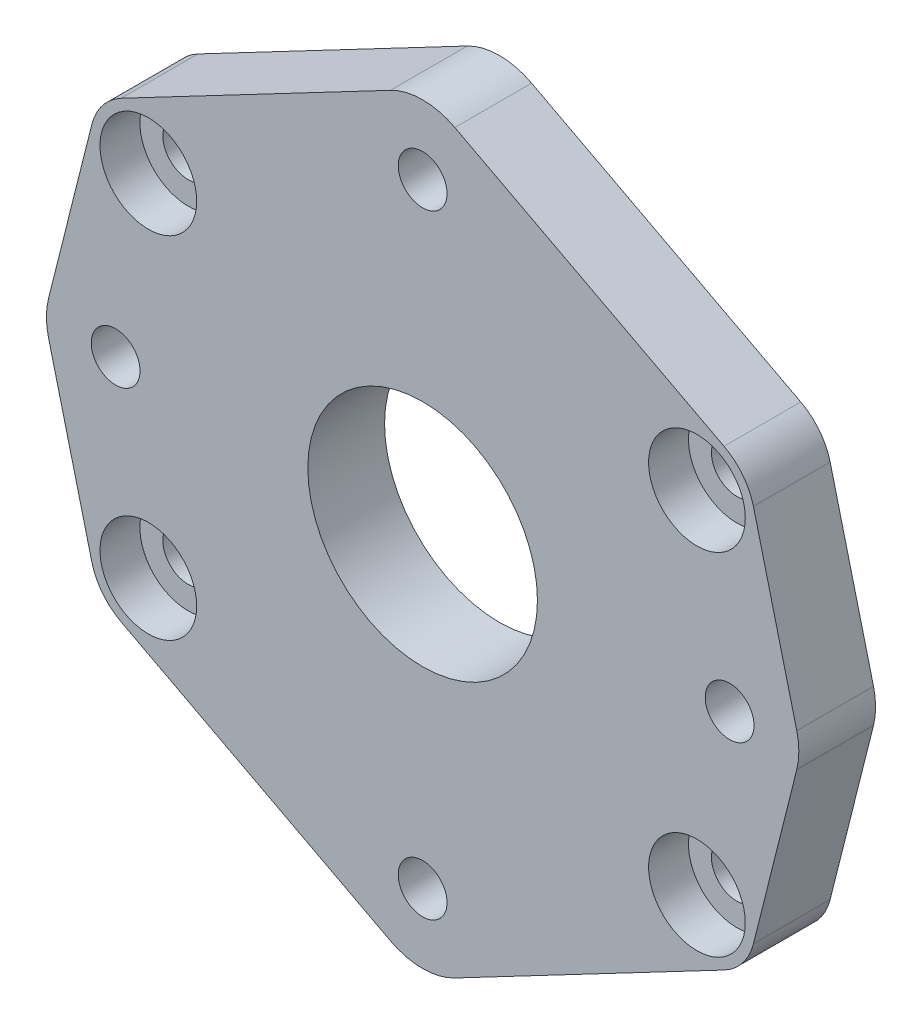
ISO-10303-21;
HEADER;
FILE_DESCRIPTION(('STEP AP214'),'2;1');
FILE_NAME('part.step','',(''),(''),'','','');
FILE_SCHEMA(('AUTOMOTIVE_DESIGN { 1 0 10303 214 1 1 1 1 }'));
ENDSEC;
DATA;
#1=APPLICATION_CONTEXT('core data for automotive mechanical design processes');
#2=APPLICATION_PROTOCOL_DEFINITION('international standard','automotive_design',2000,#1);
#3=PRODUCT_CONTEXT('',#1,'mechanical');
#4=PRODUCT('Part','Part','',(#3));
#5=PRODUCT_RELATED_PRODUCT_CATEGORY('part','',(#4));
#6=PRODUCT_DEFINITION_FORMATION('','',#4);
#7=PRODUCT_DEFINITION_CONTEXT('part definition',#1,'design');
#8=PRODUCT_DEFINITION('design','',#6,#7);
#9=PRODUCT_DEFINITION_SHAPE('','',#8);
#10=(LENGTH_UNIT() NAMED_UNIT(*) SI_UNIT(.MILLI.,.METRE.));
#11=(NAMED_UNIT(*) PLANE_ANGLE_UNIT() SI_UNIT($,.RADIAN.));
#12=(NAMED_UNIT(*) SI_UNIT($,.STERADIAN.) SOLID_ANGLE_UNIT());
#13=UNCERTAINTY_MEASURE_WITH_UNIT(LENGTH_MEASURE(1.E-05),#10,'distance_accuracy_value','');
#14=(GEOMETRIC_REPRESENTATION_CONTEXT(3) GLOBAL_UNCERTAINTY_ASSIGNED_CONTEXT((#13)) GLOBAL_UNIT_ASSIGNED_CONTEXT((#10,
#11,#12)) REPRESENTATION_CONTEXT('',''));
#15=CARTESIAN_POINT('',(0.,0.,0.));
#16=DIRECTION('',(0.,0.,1.));
#17=DIRECTION('',(1.,0.,0.));
#18=AXIS2_PLACEMENT_3D('',#15,#16,#17);
#19=CARTESIAN_POINT('',(22.6949,14.5,3.05));
#20=DIRECTION('',(0.,0.,1.));
#21=DIRECTION('',(1.,0.,0.));
#22=AXIS2_PLACEMENT_3D('',#19,#20,#21);
#23=CYLINDRICAL_SURFACE('',#22,4.);
#24=CARTESIAN_POINT('',(22.6949,14.5,6.35));
#25=DIRECTION('',(0.,0.,1.));
#26=DIRECTION('',(1.,0.,0.));
#27=AXIS2_PLACEMENT_3D('',#24,#25,#26);
#28=CIRCLE('',#27,4.);
#29=CARTESIAN_POINT('',(26.6949,14.5,6.35));
#30=VERTEX_POINT('',#29);
#31=EDGE_CURVE('E20',#30,#30,#28,.F.);
#32=ORIENTED_EDGE('',*,*,#31,.F.);
#33=EDGE_LOOP('',(#32));
#34=FACE_BOUND('',#33,.T.);
#35=CARTESIAN_POINT('',(22.6949,14.5,3.05));
#36=DIRECTION('',(0.,0.,1.));
#37=DIRECTION('',(1.,0.,0.));
#38=AXIS2_PLACEMENT_3D('',#35,#36,#37);
#39=CIRCLE('',#38,4.);
#40=CARTESIAN_POINT('',(26.6949,14.5,3.05));
#41=VERTEX_POINT('',#40);
#42=EDGE_CURVE('E289',#41,#41,#39,.T.);
#43=ORIENTED_EDGE('',*,*,#42,.F.);
#44=EDGE_LOOP('',(#43));
#45=FACE_BOUND('',#44,.T.);
#46=ADVANCED_FACE('F17',(#34,#45),#23,.F.);
#47=CARTESIAN_POINT('',(22.6949,-14.5,3.05));
#48=DIRECTION('',(0.,0.,1.));
#49=DIRECTION('',(1.,0.,0.));
#50=AXIS2_PLACEMENT_3D('',#47,#48,#49);
#51=CYLINDRICAL_SURFACE('',#50,4.);
#52=CARTESIAN_POINT('',(22.6949,-14.5,6.35));
#53=DIRECTION('',(0.,0.,1.));
#54=DIRECTION('',(1.,0.,0.));
#55=AXIS2_PLACEMENT_3D('',#52,#53,#54);
#56=CIRCLE('',#55,4.);
#57=CARTESIAN_POINT('',(26.6949,-14.5,6.35));
#58=VERTEX_POINT('',#57);
#59=EDGE_CURVE('E297',#58,#58,#56,.F.);
#60=ORIENTED_EDGE('',*,*,#59,.F.);
#61=EDGE_LOOP('',(#60));
#62=FACE_BOUND('',#61,.T.);
#63=CARTESIAN_POINT('',(22.6949,-14.5,3.05));
#64=DIRECTION('',(0.,0.,1.));
#65=DIRECTION('',(1.,0.,0.));
#66=AXIS2_PLACEMENT_3D('',#63,#64,#65);
#67=CIRCLE('',#66,4.);
#68=CARTESIAN_POINT('',(26.6949,-14.5,3.05));
#69=VERTEX_POINT('',#68);
#70=EDGE_CURVE('E286',#69,#69,#67,.T.);
#71=ORIENTED_EDGE('',*,*,#70,.F.);
#72=EDGE_LOOP('',(#71));
#73=FACE_BOUND('',#72,.T.);
#74=ADVANCED_FACE('F307',(#62,#73),#51,.F.);
#75=CARTESIAN_POINT('',(-22.6949,14.5,3.05));
#76=DIRECTION('',(0.,0.,1.));
#77=DIRECTION('',(1.,0.,0.));
#78=AXIS2_PLACEMENT_3D('',#75,#76,#77);
#79=CYLINDRICAL_SURFACE('',#78,4.);
#80=CARTESIAN_POINT('',(-22.6949,14.5,6.35));
#81=DIRECTION('',(0.,0.,1.));
#82=DIRECTION('',(1.,0.,0.));
#83=AXIS2_PLACEMENT_3D('',#80,#81,#82);
#84=CIRCLE('',#83,4.);
#85=CARTESIAN_POINT('',(-18.6949,14.5,6.35));
#86=VERTEX_POINT('',#85);
#87=EDGE_CURVE('E292',#86,#86,#84,.F.);
#88=ORIENTED_EDGE('',*,*,#87,.F.);
#89=EDGE_LOOP('',(#88));
#90=FACE_BOUND('',#89,.T.);
#91=CARTESIAN_POINT('',(-22.6949,14.5,3.05));
#92=DIRECTION('',(0.,0.,1.));
#93=DIRECTION('',(1.,0.,0.));
#94=AXIS2_PLACEMENT_3D('',#91,#92,#93);
#95=CIRCLE('',#94,4.);
#96=CARTESIAN_POINT('',(-18.6949,14.5,3.05));
#97=VERTEX_POINT('',#96);
#98=EDGE_CURVE('E283',#97,#97,#95,.T.);
#99=ORIENTED_EDGE('',*,*,#98,.F.);
#100=EDGE_LOOP('',(#99));
#101=FACE_BOUND('',#100,.T.);
#102=ADVANCED_FACE('F377',(#90,#101),#79,.F.);
#103=CARTESIAN_POINT('',(-22.6949,-14.5,3.05));
#104=DIRECTION('',(0.,0.,1.));
#105=DIRECTION('',(1.,0.,0.));
#106=AXIS2_PLACEMENT_3D('',#103,#104,#105);
#107=CYLINDRICAL_SURFACE('',#106,4.);
#108=CARTESIAN_POINT('',(-22.6949,-14.5,6.35));
#109=DIRECTION('',(0.,0.,1.));
#110=DIRECTION('',(1.,0.,0.));
#111=AXIS2_PLACEMENT_3D('',#108,#109,#110);
#112=CIRCLE('',#111,4.);
#113=CARTESIAN_POINT('',(-18.6949,-14.5,6.35));
#114=VERTEX_POINT('',#113);
#115=EDGE_CURVE('E295',#114,#114,#112,.F.);
#116=ORIENTED_EDGE('',*,*,#115,.F.);
#117=EDGE_LOOP('',(#116));
#118=FACE_BOUND('',#117,.T.);
#119=CARTESIAN_POINT('',(-22.6949,-14.5,3.05));
#120=DIRECTION('',(0.,0.,1.));
#121=DIRECTION('',(1.,0.,0.));
#122=AXIS2_PLACEMENT_3D('',#119,#120,#121);
#123=CIRCLE('',#122,4.);
#124=CARTESIAN_POINT('',(-18.6949,-14.5,3.05));
#125=VERTEX_POINT('',#124);
#126=EDGE_CURVE('E280',#125,#125,#123,.T.);
#127=ORIENTED_EDGE('',*,*,#126,.F.);
#128=EDGE_LOOP('',(#127));
#129=FACE_BOUND('',#128,.T.);
#130=ADVANCED_FACE('F373',(#118,#129),#107,.F.);
#131=CARTESIAN_POINT('',(0.,-25.4,6.35));
#132=DIRECTION('',(0.,0.,1.));
#133=DIRECTION('',(1.,0.,0.));
#134=AXIS2_PLACEMENT_3D('',#131,#132,#133);
#135=PLANE('',#134);
#136=CARTESIAN_POINT('',(0.,0.,6.35));
#137=DIRECTION('',(0.,0.,-1.));
#138=DIRECTION('',(-1.,0.,0.));
#139=AXIS2_PLACEMENT_3D('',#136,#137,#138);
#140=CIRCLE('',#139,9.5);
#141=CARTESIAN_POINT('',(-9.5,0.,6.35));
#142=VERTEX_POINT('',#141);
#143=EDGE_CURVE('E253',#142,#142,#140,.T.);
#144=ORIENTED_EDGE('',*,*,#143,.T.);
#145=EDGE_LOOP('',(#144));
#146=FACE_BOUND('',#145,.T.);
#147=CARTESIAN_POINT('',(-22.6949,-14.5,6.35));
#148=DIRECTION('',(0.,0.,-1.));
#149=DIRECTION('',(-1.,0.,0.));
#150=AXIS2_PLACEMENT_3D('',#147,#148,#149);
#151=CIRCLE('',#150,4.8184481321629);
#152=CARTESIAN_POINT('',(-24.9364972451946,-18.7652882895157,6.35));
#153=VERTEX_POINT('',#152);
#154=CARTESIAN_POINT('',(-27.3681433155589,-15.6739843763561,6.35));
#155=VERTEX_POINT('',#154);
#156=EDGE_CURVE('E165',#153,#155,#151,.T.);
#157=ORIENTED_EDGE('',*,*,#156,.F.);
#158=DIRECTION('',(-0.885199585535674,0.465211450597973,0.));
#159=VECTOR('',#158,1.);
#160=CARTESIAN_POINT('',(-24.9364972451946,-18.7652882895157,6.35));
#161=LINE('',#160,#159);
#162=CARTESIAN_POINT('',(-2.66459162559,-30.4701576660727,6.35));
#163=VERTEX_POINT('',#162);
#164=EDGE_CURVE('E158',#153,#163,#161,.F.);
#165=ORIENTED_EDGE('',*,*,#164,.T.);
#166=CARTESIAN_POINT('',(0.,-25.4,6.35));
#167=DIRECTION('',(0.,0.,-1.));
#168=DIRECTION('',(-1.,0.,0.));
#169=AXIS2_PLACEMENT_3D('',#166,#167,#168);
#170=CIRCLE('',#169,5.7277);
#171=CARTESIAN_POINT('',(2.66459162559002,-30.4701576660727,6.35));
#172=VERTEX_POINT('',#171);
#173=EDGE_CURVE('E144',#172,#163,#170,.T.);
#174=ORIENTED_EDGE('',*,*,#173,.F.);
#175=DIRECTION('',(-0.885199585535674,-0.465211450597973,0.));
#176=VECTOR('',#175,1.);
#177=CARTESIAN_POINT('',(24.9364972451946,-18.7652882895157,6.35));
#178=LINE('',#177,#176);
#179=CARTESIAN_POINT('',(24.9364972451946,-18.7652882895157,6.35));
#180=VERTEX_POINT('',#179);
#181=EDGE_CURVE('E138',#172,#180,#178,.F.);
#182=ORIENTED_EDGE('',*,*,#181,.T.);
#183=CARTESIAN_POINT('',(22.6949,-14.5,6.35));
#184=DIRECTION('',(0.,0.,-1.));
#185=DIRECTION('',(-1.,0.,0.));
#186=AXIS2_PLACEMENT_3D('',#183,#184,#185);
#187=CIRCLE('',#186,4.81844813216289);
#188=CARTESIAN_POINT('',(27.3681433155589,-15.6739843763561,6.35));
#189=VERTEX_POINT('',#188);
#190=EDGE_CURVE('E128',#189,#180,#187,.T.);
#191=ORIENTED_EDGE('',*,*,#190,.F.);
#192=DIRECTION('',(-0.243643667868879,-0.969864816924193,0.));
#193=VECTOR('',#192,1.);
#194=CARTESIAN_POINT('',(27.3681433155589,-15.6739843763561,6.35));
#195=LINE('',#194,#193);
#196=CARTESIAN_POINT('',(30.9550947118967,-1.39551783645258,6.35));
#197=VERTEX_POINT('',#196);
#198=EDGE_CURVE('E154',#189,#197,#195,.F.);
#199=ORIENTED_EDGE('',*,*,#198,.T.);
#200=CARTESIAN_POINT('',(25.4,0.,6.35));
#201=DIRECTION('',(0.,0.,-1.));
#202=DIRECTION('',(-1.,0.,0.));
#203=AXIS2_PLACEMENT_3D('',#200,#201,#202);
#204=CIRCLE('',#203,5.72770000000001);
#205=CARTESIAN_POINT('',(30.9550947118967,1.39551783645258,6.35));
#206=VERTEX_POINT('',#205);
#207=EDGE_CURVE('E187',#206,#197,#204,.T.);
#208=ORIENTED_EDGE('',*,*,#207,.F.);
#209=DIRECTION('',(0.243643667868879,-0.969864816924193,0.));
#210=VECTOR('',#209,1.);
#211=CARTESIAN_POINT('',(27.3681433155589,15.6739843763561,6.35));
#212=LINE('',#211,#210);
#213=CARTESIAN_POINT('',(27.3681433155589,15.6739843763561,6.35));
#214=VERTEX_POINT('',#213);
#215=EDGE_CURVE('E182',#206,#214,#212,.F.);
#216=ORIENTED_EDGE('',*,*,#215,.T.);
#217=CARTESIAN_POINT('',(22.6949,14.5,6.35));
#218=DIRECTION('',(0.,0.,-1.));
#219=DIRECTION('',(-1.,0.,0.));
#220=AXIS2_PLACEMENT_3D('',#217,#218,#219);
#221=CIRCLE('',#220,4.81844813216289);
#222=CARTESIAN_POINT('',(24.9364972451946,18.7652882895157,6.35));
#223=VERTEX_POINT('',#222);
#224=EDGE_CURVE('E185',#223,#214,#221,.T.);
#225=ORIENTED_EDGE('',*,*,#224,.F.);
#226=DIRECTION('',(0.885199585535674,-0.465211450597973,0.));
#227=VECTOR('',#226,1.);
#228=CARTESIAN_POINT('',(24.9364972451946,18.7652882895157,6.35));
#229=LINE('',#228,#227);
#230=CARTESIAN_POINT('',(2.66459162559001,30.4701576660727,6.35));
#231=VERTEX_POINT('',#230);
#232=EDGE_CURVE('E177',#223,#231,#229,.F.);
#233=ORIENTED_EDGE('',*,*,#232,.T.);
#234=CARTESIAN_POINT('',(0.,25.4,6.35));
#235=DIRECTION('',(0.,0.,-1.));
#236=DIRECTION('',(-1.,0.,0.));
#237=AXIS2_PLACEMENT_3D('',#234,#235,#236);
#238=CIRCLE('',#237,5.7277);
#239=CARTESIAN_POINT('',(-2.66459162559001,30.4701576660727,6.35));
#240=VERTEX_POINT('',#239);
#241=EDGE_CURVE('E180',#240,#231,#238,.T.);
#242=ORIENTED_EDGE('',*,*,#241,.F.);
#243=DIRECTION('',(0.885199585535674,0.465211450597973,0.));
#244=VECTOR('',#243,1.);
#245=CARTESIAN_POINT('',(-24.9364972451946,18.7652882895157,6.35));
#246=LINE('',#245,#244);
#247=CARTESIAN_POINT('',(-24.9364972451946,18.7652882895157,6.35));
#248=VERTEX_POINT('',#247);
#249=EDGE_CURVE('E172',#240,#248,#246,.F.);
#250=ORIENTED_EDGE('',*,*,#249,.T.);
#251=CARTESIAN_POINT('',(-22.6949,14.5,6.35));
#252=DIRECTION('',(0.,0.,-1.));
#253=DIRECTION('',(-1.,0.,0.));
#254=AXIS2_PLACEMENT_3D('',#251,#252,#253);
#255=CIRCLE('',#254,4.81844813216289);
#256=CARTESIAN_POINT('',(-27.3681433155589,15.6739843763561,6.35));
#257=VERTEX_POINT('',#256);
#258=EDGE_CURVE('E175',#257,#248,#255,.T.);
#259=ORIENTED_EDGE('',*,*,#258,.F.);
#260=DIRECTION('',(0.243643667868879,0.969864816924194,0.));
#261=VECTOR('',#260,1.);
#262=CARTESIAN_POINT('',(-27.3681433155589,15.6739843763561,6.35));
#263=LINE('',#262,#261);
#264=CARTESIAN_POINT('',(-30.9550947118967,1.39551783645258,6.35));
#265=VERTEX_POINT('',#264);
#266=EDGE_CURVE('E167',#257,#265,#263,.F.);
#267=ORIENTED_EDGE('',*,*,#266,.T.);
#268=CARTESIAN_POINT('',(-25.4,0.,6.35));
#269=DIRECTION('',(0.,0.,-1.));
#270=DIRECTION('',(-1.,0.,0.));
#271=AXIS2_PLACEMENT_3D('',#268,#269,#270);
#272=CIRCLE('',#271,5.7277);
#273=CARTESIAN_POINT('',(-30.9550947118967,-1.39551783645258,6.35));
#274=VERTEX_POINT('',#273);
#275=EDGE_CURVE('E170',#274,#265,#272,.T.);
#276=ORIENTED_EDGE('',*,*,#275,.F.);
#277=DIRECTION('',(-0.243643667868879,0.969864816924194,0.));
#278=VECTOR('',#277,1.);
#279=CARTESIAN_POINT('',(-27.3681433155589,-15.6739843763561,6.35));
#280=LINE('',#279,#278);
#281=EDGE_CURVE('E162',#274,#155,#280,.F.);
#282=ORIENTED_EDGE('',*,*,#281,.T.);
#283=EDGE_LOOP('',(#157,#165,#174,#182,#191,#199,#208,#216,#225,#233,#242,#250,#259,#267,#276,#282));
#284=FACE_BOUND('',#283,.T.);
#285=CARTESIAN_POINT('',(0.,-25.4,6.35));
#286=DIRECTION('',(0.,0.,1.));
#287=DIRECTION('',(1.,0.,0.));
#288=AXIS2_PLACEMENT_3D('',#285,#286,#287);
#289=CIRCLE('',#288,2.01929999999999);
#290=CARTESIAN_POINT('',(2.0193,-25.4,6.35));
#291=VERTEX_POINT('',#290);
#292=EDGE_CURVE('E148',#291,#291,#289,.F.);
#293=ORIENTED_EDGE('',*,*,#292,.T.);
#294=EDGE_LOOP('',(#293));
#295=FACE_BOUND('',#294,.T.);
#296=CARTESIAN_POINT('',(25.4,0.,6.35));
#297=DIRECTION('',(0.,0.,1.));
#298=DIRECTION('',(1.,0.,0.));
#299=AXIS2_PLACEMENT_3D('',#296,#297,#298);
#300=CIRCLE('',#299,2.01929999999999);
#301=CARTESIAN_POINT('',(27.4193,0.,6.35));
#302=VERTEX_POINT('',#301);
#303=EDGE_CURVE('E271',#302,#302,#300,.F.);
#304=ORIENTED_EDGE('',*,*,#303,.T.);
#305=EDGE_LOOP('',(#304));
#306=FACE_BOUND('',#305,.T.);
#307=CARTESIAN_POINT('',(0.,25.4,6.35));
#308=DIRECTION('',(0.,0.,1.));
#309=DIRECTION('',(1.,0.,0.));
#310=AXIS2_PLACEMENT_3D('',#307,#308,#309);
#311=CIRCLE('',#310,2.01929999999999);
#312=CARTESIAN_POINT('',(2.0193,25.4,6.35));
#313=VERTEX_POINT('',#312);
#314=EDGE_CURVE('E274',#313,#313,#311,.F.);
#315=ORIENTED_EDGE('',*,*,#314,.T.);
#316=EDGE_LOOP('',(#315));
#317=FACE_BOUND('',#316,.T.);
#318=CARTESIAN_POINT('',(-25.4,0.,6.35));
#319=DIRECTION('',(0.,0.,1.));
#320=DIRECTION('',(1.,0.,0.));
#321=AXIS2_PLACEMENT_3D('',#318,#319,#320);
#322=CIRCLE('',#321,2.01929999999999);
#323=CARTESIAN_POINT('',(-23.3807,0.,6.35));
#324=VERTEX_POINT('',#323);
#325=EDGE_CURVE('E277',#324,#324,#322,.F.);
#326=ORIENTED_EDGE('',*,*,#325,.T.);
#327=EDGE_LOOP('',(#326));
#328=FACE_BOUND('',#327,.T.);
#329=ORIENTED_EDGE('',*,*,#87,.T.);
#330=EDGE_LOOP('',(#329));
#331=FACE_BOUND('',#330,.T.);
#332=ORIENTED_EDGE('',*,*,#115,.T.);
#333=EDGE_LOOP('',(#332));
#334=FACE_BOUND('',#333,.T.);
#335=ORIENTED_EDGE('',*,*,#59,.T.);
#336=EDGE_LOOP('',(#335));
#337=FACE_BOUND('',#336,.T.);
#338=ORIENTED_EDGE('',*,*,#31,.T.);
#339=EDGE_LOOP('',(#338));
#340=FACE_BOUND('',#339,.T.);
#341=ADVANCED_FACE('F141',(#146,#284,#295,#306,#317,#328,#331,#334,#337,#340),#135,.T.);
#342=CARTESIAN_POINT('',(22.6949,14.5,3.05));
#343=DIRECTION('',(0.,0.,1.));
#344=DIRECTION('',(1.,0.,0.));
#345=AXIS2_PLACEMENT_3D('',#342,#343,#344);
#346=PLANE('',#345);
#347=ORIENTED_EDGE('',*,*,#42,.T.);
#348=EDGE_LOOP('',(#347));
#349=FACE_BOUND('',#348,.T.);
#350=CARTESIAN_POINT('',(22.6949,14.5,3.05));
#351=DIRECTION('',(0.,0.,-1.));
#352=DIRECTION('',(-1.,0.,0.));
#353=AXIS2_PLACEMENT_3D('',#350,#351,#352);
#354=CIRCLE('',#353,2.1);
#355=CARTESIAN_POINT('',(20.5949,14.5,3.05));
#356=VERTEX_POINT('',#355);
#357=EDGE_CURVE('E250',#356,#356,#354,.T.);
#358=ORIENTED_EDGE('',*,*,#357,.T.);
#359=EDGE_LOOP('',(#358));
#360=FACE_BOUND('',#359,.T.);
#361=ADVANCED_FACE('F310',(#349,#360),#346,.T.);
#362=CARTESIAN_POINT('',(22.6949,-14.5,3.05));
#363=DIRECTION('',(0.,0.,1.));
#364=DIRECTION('',(1.,0.,0.));
#365=AXIS2_PLACEMENT_3D('',#362,#363,#364);
#366=PLANE('',#365);
#367=ORIENTED_EDGE('',*,*,#70,.T.);
#368=EDGE_LOOP('',(#367));
#369=FACE_BOUND('',#368,.T.);
#370=CARTESIAN_POINT('',(22.6949,-14.5,3.05));
#371=DIRECTION('',(0.,0.,-1.));
#372=DIRECTION('',(-1.,0.,0.));
#373=AXIS2_PLACEMENT_3D('',#370,#371,#372);
#374=CIRCLE('',#373,2.1);
#375=CARTESIAN_POINT('',(20.5949,-14.5,3.05));
#376=VERTEX_POINT('',#375);
#377=EDGE_CURVE('E247',#376,#376,#374,.T.);
#378=ORIENTED_EDGE('',*,*,#377,.T.);
#379=EDGE_LOOP('',(#378));
#380=FACE_BOUND('',#379,.T.);
#381=ADVANCED_FACE('F313',(#369,#380),#366,.T.);
#382=CARTESIAN_POINT('',(-22.6949,14.5,3.05));
#383=DIRECTION('',(0.,0.,1.));
#384=DIRECTION('',(1.,0.,0.));
#385=AXIS2_PLACEMENT_3D('',#382,#383,#384);
#386=PLANE('',#385);
#387=ORIENTED_EDGE('',*,*,#98,.T.);
#388=EDGE_LOOP('',(#387));
#389=FACE_BOUND('',#388,.T.);
#390=CARTESIAN_POINT('',(-22.6949,14.5,3.05));
#391=DIRECTION('',(0.,0.,-1.));
#392=DIRECTION('',(-1.,0.,0.));
#393=AXIS2_PLACEMENT_3D('',#390,#391,#392);
#394=CIRCLE('',#393,2.1);
#395=CARTESIAN_POINT('',(-24.7949,14.5,3.05));
#396=VERTEX_POINT('',#395);
#397=EDGE_CURVE('E244',#396,#396,#394,.T.);
#398=ORIENTED_EDGE('',*,*,#397,.T.);
#399=EDGE_LOOP('',(#398));
#400=FACE_BOUND('',#399,.T.);
#401=ADVANCED_FACE('F359',(#389,#400),#386,.T.);
#402=CARTESIAN_POINT('',(-22.6949,-14.5,3.05));
#403=DIRECTION('',(0.,0.,1.));
#404=DIRECTION('',(1.,0.,0.));
#405=AXIS2_PLACEMENT_3D('',#402,#403,#404);
#406=PLANE('',#405);
#407=ORIENTED_EDGE('',*,*,#126,.T.);
#408=EDGE_LOOP('',(#407));
#409=FACE_BOUND('',#408,.T.);
#410=CARTESIAN_POINT('',(-22.6949,-14.5,3.05));
#411=DIRECTION('',(0.,0.,-1.));
#412=DIRECTION('',(-1.,0.,0.));
#413=AXIS2_PLACEMENT_3D('',#410,#411,#412);
#414=CIRCLE('',#413,2.1);
#415=CARTESIAN_POINT('',(-24.7949,-14.5,3.05));
#416=VERTEX_POINT('',#415);
#417=EDGE_CURVE('E241',#416,#416,#414,.T.);
#418=ORIENTED_EDGE('',*,*,#417,.T.);
#419=EDGE_LOOP('',(#418));
#420=FACE_BOUND('',#419,.T.);
#421=ADVANCED_FACE('F348',(#409,#420),#406,.T.);
#422=CARTESIAN_POINT('',(-25.4,0.,6.35));
#423=DIRECTION('',(0.,0.,1.));
#424=DIRECTION('',(1.,0.,0.));
#425=AXIS2_PLACEMENT_3D('',#422,#423,#424);
#426=CYLINDRICAL_SURFACE('',#425,2.01929999999999);
#427=ORIENTED_EDGE('',*,*,#325,.F.);
#428=EDGE_LOOP('',(#427));
#429=FACE_BOUND('',#428,.T.);
#430=CARTESIAN_POINT('',(-25.4,0.,0.));
#431=DIRECTION('',(0.,0.,1.));
#432=DIRECTION('',(1.,0.,0.));
#433=AXIS2_PLACEMENT_3D('',#430,#431,#432);
#434=CIRCLE('',#433,2.01929999999999);
#435=CARTESIAN_POINT('',(-23.3807,0.,0.));
#436=VERTEX_POINT('',#435);
#437=EDGE_CURVE('E238',#436,#436,#434,.F.);
#438=ORIENTED_EDGE('',*,*,#437,.T.);
#439=EDGE_LOOP('',(#438));
#440=FACE_BOUND('',#439,.T.);
#441=ADVANCED_FACE('F345',(#429,#440),#426,.F.);
#442=CARTESIAN_POINT('',(0.,25.4,6.35));
#443=DIRECTION('',(0.,0.,1.));
#444=DIRECTION('',(1.,0.,0.));
#445=AXIS2_PLACEMENT_3D('',#442,#443,#444);
#446=CYLINDRICAL_SURFACE('',#445,2.01929999999999);
#447=ORIENTED_EDGE('',*,*,#314,.F.);
#448=EDGE_LOOP('',(#447));
#449=FACE_BOUND('',#448,.T.);
#450=CARTESIAN_POINT('',(0.,25.4,0.));
#451=DIRECTION('',(0.,0.,1.));
#452=DIRECTION('',(1.,0.,0.));
#453=AXIS2_PLACEMENT_3D('',#450,#451,#452);
#454=CIRCLE('',#453,2.01929999999999);
#455=CARTESIAN_POINT('',(2.0193,25.4,0.));
#456=VERTEX_POINT('',#455);
#457=EDGE_CURVE('E235',#456,#456,#454,.F.);
#458=ORIENTED_EDGE('',*,*,#457,.T.);
#459=EDGE_LOOP('',(#458));
#460=FACE_BOUND('',#459,.T.);
#461=ADVANCED_FACE('F347',(#449,#460),#446,.F.);
#462=CARTESIAN_POINT('',(25.4,0.,6.35));
#463=DIRECTION('',(0.,0.,1.));
#464=DIRECTION('',(1.,0.,0.));
#465=AXIS2_PLACEMENT_3D('',#462,#463,#464);
#466=CYLINDRICAL_SURFACE('',#465,2.01929999999999);
#467=ORIENTED_EDGE('',*,*,#303,.F.);
#468=EDGE_LOOP('',(#467));
#469=FACE_BOUND('',#468,.T.);
#470=CARTESIAN_POINT('',(25.4,0.,0.));
#471=DIRECTION('',(0.,0.,1.));
#472=DIRECTION('',(1.,0.,0.));
#473=AXIS2_PLACEMENT_3D('',#470,#471,#472);
#474=CIRCLE('',#473,2.01929999999999);
#475=CARTESIAN_POINT('',(27.4193,0.,0.));
#476=VERTEX_POINT('',#475);
#477=EDGE_CURVE('E232',#476,#476,#474,.F.);
#478=ORIENTED_EDGE('',*,*,#477,.T.);
#479=EDGE_LOOP('',(#478));
#480=FACE_BOUND('',#479,.T.);
#481=ADVANCED_FACE('F356',(#469,#480),#466,.F.);
#482=CARTESIAN_POINT('',(0.,-25.4,6.35));
#483=DIRECTION('',(0.,0.,1.));
#484=DIRECTION('',(1.,0.,0.));
#485=AXIS2_PLACEMENT_3D('',#482,#483,#484);
#486=CYLINDRICAL_SURFACE('',#485,2.01929999999999);
#487=ORIENTED_EDGE('',*,*,#292,.F.);
#488=EDGE_LOOP('',(#487));
#489=FACE_BOUND('',#488,.T.);
#490=CARTESIAN_POINT('',(0.,-25.4,0.));
#491=DIRECTION('',(0.,0.,1.));
#492=DIRECTION('',(1.,0.,0.));
#493=AXIS2_PLACEMENT_3D('',#490,#491,#492);
#494=CIRCLE('',#493,2.01929999999999);
#495=CARTESIAN_POINT('',(2.0193,-25.4,0.));
#496=VERTEX_POINT('',#495);
#497=EDGE_CURVE('E229',#496,#496,#494,.F.);
#498=ORIENTED_EDGE('',*,*,#497,.T.);
#499=EDGE_LOOP('',(#498));
#500=FACE_BOUND('',#499,.T.);
#501=ADVANCED_FACE('F465',(#489,#500),#486,.F.);
#502=CARTESIAN_POINT('',(24.9364972451946,-18.7652882895157,6.35));
#503=DIRECTION('',(-0.465211450597973,0.885199585535674,0.));
#504=DIRECTION('',(-0.885199585535674,-0.465211450597973,0.));
#505=AXIS2_PLACEMENT_3D('',#502,#503,#504);
#506=PLANE('',#505);
#507=DIRECTION('',(0.,0.,-1.));
#508=VECTOR('',#507,1.);
#509=CARTESIAN_POINT('',(24.9364972451946,-18.7652882895157,6.35));
#510=LINE('',#509,#508);
#511=CARTESIAN_POINT('',(24.9364972451946,-18.7652882895157,0.));
#512=VERTEX_POINT('',#511);
#513=EDGE_CURVE('E135',#180,#512,#510,.T.);
#514=ORIENTED_EDGE('',*,*,#513,.F.);
#515=ORIENTED_EDGE('',*,*,#181,.F.);
#516=DIRECTION('',(0.,0.,-1.));
#517=VECTOR('',#516,1.);
#518=CARTESIAN_POINT('',(2.66459162559002,-30.4701576660727,6.35));
#519=LINE('',#518,#517);
#520=CARTESIAN_POINT('',(2.66459162559002,-30.4701576660727,0.));
#521=VERTEX_POINT('',#520);
#522=EDGE_CURVE('E159',#521,#172,#519,.F.);
#523=ORIENTED_EDGE('',*,*,#522,.F.);
#524=DIRECTION('',(0.885199585535674,0.465211450597973,0.));
#525=VECTOR('',#524,1.);
#526=CARTESIAN_POINT('',(2.66459162559002,-30.4701576660727,0.));
#527=LINE('',#526,#525);
#528=EDGE_CURVE('E152',#521,#512,#527,.T.);
#529=ORIENTED_EDGE('',*,*,#528,.T.);
#530=EDGE_LOOP('',(#514,#515,#523,#529));
#531=FACE_BOUND('',#530,.T.);
#532=ADVANCED_FACE('F151',(#531),#506,.F.);
#533=CARTESIAN_POINT('',(22.6949,-14.5,6.35));
#534=DIRECTION('',(0.,0.,-1.));
#535=DIRECTION('',(-1.,0.,0.));
#536=AXIS2_PLACEMENT_3D('',#533,#534,#535);
#537=CYLINDRICAL_SURFACE('',#536,4.81844813216289);
#538=ORIENTED_EDGE('',*,*,#190,.T.);
#539=ORIENTED_EDGE('',*,*,#513,.T.);
#540=CARTESIAN_POINT('',(22.6949,-14.5,0.));
#541=DIRECTION('',(0.,0.,-1.));
#542=DIRECTION('',(-1.,0.,0.));
#543=AXIS2_PLACEMENT_3D('',#540,#541,#542);
#544=CIRCLE('',#543,4.81844813216289);
#545=CARTESIAN_POINT('',(27.3681433155589,-15.6739843763561,0.));
#546=VERTEX_POINT('',#545);
#547=EDGE_CURVE('E227',#512,#546,#544,.F.);
#548=ORIENTED_EDGE('',*,*,#547,.T.);
#549=DIRECTION('',(0.,0.,1.));
#550=VECTOR('',#549,1.);
#551=CARTESIAN_POINT('',(27.3681433155589,-15.6739843763561,6.35));
#552=LINE('',#551,#550);
#553=EDGE_CURVE('E137',#546,#189,#552,.T.);
#554=ORIENTED_EDGE('',*,*,#553,.T.);
#555=EDGE_LOOP('',(#538,#539,#548,#554));
#556=FACE_BOUND('',#555,.T.);
#557=ADVANCED_FACE('F132',(#556),#537,.T.);
#558=CARTESIAN_POINT('',(27.3681433155589,-15.6739843763561,6.35));
#559=DIRECTION('',(-0.969864816924193,0.243643667868879,0.));
#560=DIRECTION('',(-0.243643667868879,-0.969864816924193,0.));
#561=AXIS2_PLACEMENT_3D('',#558,#559,#560);
#562=PLANE('',#561);
#563=DIRECTION('',(0.,0.,-1.));
#564=VECTOR('',#563,1.);
#565=CARTESIAN_POINT('',(30.9550947118967,-1.39551783645258,6.35));
#566=LINE('',#565,#564);
#567=CARTESIAN_POINT('',(30.9550947118967,-1.39551783645258,0.));
#568=VERTEX_POINT('',#567);
#569=EDGE_CURVE('E267',#197,#568,#566,.T.);
#570=ORIENTED_EDGE('',*,*,#569,.F.);
#571=ORIENTED_EDGE('',*,*,#198,.F.);
#572=ORIENTED_EDGE('',*,*,#553,.F.);
#573=DIRECTION('',(0.243643667868879,0.969864816924193,0.));
#574=VECTOR('',#573,1.);
#575=CARTESIAN_POINT('',(27.3681433155589,-15.6739843763561,0.));
#576=LINE('',#575,#574);
#577=EDGE_CURVE('E226',#546,#568,#576,.T.);
#578=ORIENTED_EDGE('',*,*,#577,.T.);
#579=EDGE_LOOP('',(#570,#571,#572,#578));
#580=FACE_BOUND('',#579,.T.);
#581=ADVANCED_FACE('F456',(#580),#562,.F.);
#582=CARTESIAN_POINT('',(25.4,0.,6.35));
#583=DIRECTION('',(0.,0.,-1.));
#584=DIRECTION('',(-1.,0.,0.));
#585=AXIS2_PLACEMENT_3D('',#582,#583,#584);
#586=CYLINDRICAL_SURFACE('',#585,5.72770000000001);
#587=ORIENTED_EDGE('',*,*,#207,.T.);
#588=ORIENTED_EDGE('',*,*,#569,.T.);
#589=CARTESIAN_POINT('',(25.4,0.,0.));
#590=DIRECTION('',(0.,0.,-1.));
#591=DIRECTION('',(-1.,0.,0.));
#592=AXIS2_PLACEMENT_3D('',#589,#590,#591);
#593=CIRCLE('',#592,5.72770000000001);
#594=CARTESIAN_POINT('',(30.9550947118967,1.39551783645258,0.));
#595=VERTEX_POINT('',#594);
#596=EDGE_CURVE('E223',#568,#595,#593,.F.);
#597=ORIENTED_EDGE('',*,*,#596,.T.);
#598=DIRECTION('',(0.,0.,1.));
#599=VECTOR('',#598,1.);
#600=CARTESIAN_POINT('',(30.9550947118967,1.39551783645258,6.35));
#601=LINE('',#600,#599);
#602=EDGE_CURVE('E186',#595,#206,#601,.T.);
#603=ORIENTED_EDGE('',*,*,#602,.T.);
#604=EDGE_LOOP('',(#587,#588,#597,#603));
#605=FACE_BOUND('',#604,.T.);
#606=ADVANCED_FACE('F452',(#605),#586,.T.);
#607=CARTESIAN_POINT('',(27.3681433155589,15.6739843763561,6.35));
#608=DIRECTION('',(-0.969864816924193,-0.243643667868879,0.));
#609=DIRECTION('',(0.243643667868879,-0.969864816924193,0.));
#610=AXIS2_PLACEMENT_3D('',#607,#608,#609);
#611=PLANE('',#610);
#612=DIRECTION('',(0.,0.,-1.));
#613=VECTOR('',#612,1.);
#614=CARTESIAN_POINT('',(27.3681433155589,15.6739843763561,6.35));
#615=LINE('',#614,#613);
#616=CARTESIAN_POINT('',(27.3681433155589,15.6739843763561,0.));
#617=VERTEX_POINT('',#616);
#618=EDGE_CURVE('E266',#214,#617,#615,.T.);
#619=ORIENTED_EDGE('',*,*,#618,.F.);
#620=ORIENTED_EDGE('',*,*,#215,.F.);
#621=ORIENTED_EDGE('',*,*,#602,.F.);
#622=DIRECTION('',(-0.243643667868879,0.969864816924193,0.));
#623=VECTOR('',#622,1.);
#624=CARTESIAN_POINT('',(30.9550947118967,1.39551783645258,0.));
#625=LINE('',#624,#623);
#626=EDGE_CURVE('E222',#595,#617,#625,.T.);
#627=ORIENTED_EDGE('',*,*,#626,.T.);
#628=EDGE_LOOP('',(#619,#620,#621,#627));
#629=FACE_BOUND('',#628,.T.);
#630=ADVANCED_FACE('F448',(#629),#611,.F.);
#631=CARTESIAN_POINT('',(22.6949,14.5,6.35));
#632=DIRECTION('',(0.,0.,-1.));
#633=DIRECTION('',(-1.,0.,0.));
#634=AXIS2_PLACEMENT_3D('',#631,#632,#633);
#635=CYLINDRICAL_SURFACE('',#634,4.81844813216289);
#636=ORIENTED_EDGE('',*,*,#224,.T.);
#637=ORIENTED_EDGE('',*,*,#618,.T.);
#638=CARTESIAN_POINT('',(22.6949,14.5,0.));
#639=DIRECTION('',(0.,0.,-1.));
#640=DIRECTION('',(-1.,0.,0.));
#641=AXIS2_PLACEMENT_3D('',#638,#639,#640);
#642=CIRCLE('',#641,4.81844813216289);
#643=CARTESIAN_POINT('',(24.9364972451946,18.7652882895157,0.));
#644=VERTEX_POINT('',#643);
#645=EDGE_CURVE('E219',#617,#644,#642,.F.);
#646=ORIENTED_EDGE('',*,*,#645,.T.);
#647=DIRECTION('',(0.,0.,1.));
#648=VECTOR('',#647,1.);
#649=CARTESIAN_POINT('',(24.9364972451946,18.7652882895157,6.35));
#650=LINE('',#649,#648);
#651=EDGE_CURVE('E181',#644,#223,#650,.T.);
#652=ORIENTED_EDGE('',*,*,#651,.T.);
#653=EDGE_LOOP('',(#636,#637,#646,#652));
#654=FACE_BOUND('',#653,.T.);
#655=ADVANCED_FACE('F444',(#654),#635,.T.);
#656=CARTESIAN_POINT('',(24.9364972451946,18.7652882895157,6.35));
#657=DIRECTION('',(-0.465211450597973,-0.885199585535674,0.));
#658=DIRECTION('',(0.885199585535674,-0.465211450597973,0.));
#659=AXIS2_PLACEMENT_3D('',#656,#657,#658);
#660=PLANE('',#659);
#661=DIRECTION('',(0.,0.,-1.));
#662=VECTOR('',#661,1.);
#663=CARTESIAN_POINT('',(2.66459162559001,30.4701576660727,6.35));
#664=LINE('',#663,#662);
#665=CARTESIAN_POINT('',(2.66459162559001,30.4701576660727,0.));
#666=VERTEX_POINT('',#665);
#667=EDGE_CURVE('E264',#231,#666,#664,.T.);
#668=ORIENTED_EDGE('',*,*,#667,.F.);
#669=ORIENTED_EDGE('',*,*,#232,.F.);
#670=ORIENTED_EDGE('',*,*,#651,.F.);
#671=DIRECTION('',(-0.885199585535674,0.465211450597973,0.));
#672=VECTOR('',#671,1.);
#673=CARTESIAN_POINT('',(24.9364972451946,18.7652882895157,0.));
#674=LINE('',#673,#672);
#675=EDGE_CURVE('E218',#644,#666,#674,.T.);
#676=ORIENTED_EDGE('',*,*,#675,.T.);
#677=EDGE_LOOP('',(#668,#669,#670,#676));
#678=FACE_BOUND('',#677,.T.);
#679=ADVANCED_FACE('F440',(#678),#660,.F.);
#680=CARTESIAN_POINT('',(0.,25.4,6.35));
#681=DIRECTION('',(0.,0.,-1.));
#682=DIRECTION('',(-1.,0.,0.));
#683=AXIS2_PLACEMENT_3D('',#680,#681,#682);
#684=CYLINDRICAL_SURFACE('',#683,5.7277);
#685=ORIENTED_EDGE('',*,*,#241,.T.);
#686=ORIENTED_EDGE('',*,*,#667,.T.);
#687=CARTESIAN_POINT('',(0.,25.4,0.));
#688=DIRECTION('',(0.,0.,-1.));
#689=DIRECTION('',(-1.,0.,0.));
#690=AXIS2_PLACEMENT_3D('',#687,#688,#689);
#691=CIRCLE('',#690,5.7277);
#692=CARTESIAN_POINT('',(-2.66459162559001,30.4701576660727,0.));
#693=VERTEX_POINT('',#692);
#694=EDGE_CURVE('E215',#666,#693,#691,.F.);
#695=ORIENTED_EDGE('',*,*,#694,.T.);
#696=DIRECTION('',(0.,0.,1.));
#697=VECTOR('',#696,1.);
#698=CARTESIAN_POINT('',(-2.66459162559001,30.4701576660727,6.35));
#699=LINE('',#698,#697);
#700=EDGE_CURVE('E176',#693,#240,#699,.T.);
#701=ORIENTED_EDGE('',*,*,#700,.T.);
#702=EDGE_LOOP('',(#685,#686,#695,#701));
#703=FACE_BOUND('',#702,.T.);
#704=ADVANCED_FACE('F436',(#703),#684,.T.);
#705=CARTESIAN_POINT('',(-24.9364972451946,18.7652882895157,6.35));
#706=DIRECTION('',(0.465211450597973,-0.885199585535674,0.));
#707=DIRECTION('',(0.885199585535674,0.465211450597973,0.));
#708=AXIS2_PLACEMENT_3D('',#705,#706,#707);
#709=PLANE('',#708);
#710=DIRECTION('',(0.,0.,-1.));
#711=VECTOR('',#710,1.);
#712=CARTESIAN_POINT('',(-24.9364972451946,18.7652882895157,6.35));
#713=LINE('',#712,#711);
#714=CARTESIAN_POINT('',(-24.9364972451946,18.7652882895157,0.));
#715=VERTEX_POINT('',#714);
#716=EDGE_CURVE('E262',#248,#715,#713,.T.);
#717=ORIENTED_EDGE('',*,*,#716,.F.);
#718=ORIENTED_EDGE('',*,*,#249,.F.);
#719=ORIENTED_EDGE('',*,*,#700,.F.);
#720=DIRECTION('',(-0.885199585535674,-0.465211450597973,0.));
#721=VECTOR('',#720,1.);
#722=CARTESIAN_POINT('',(-2.66459162559001,30.4701576660727,0.));
#723=LINE('',#722,#721);
#724=EDGE_CURVE('E214',#693,#715,#723,.T.);
#725=ORIENTED_EDGE('',*,*,#724,.T.);
#726=EDGE_LOOP('',(#717,#718,#719,#725));
#727=FACE_BOUND('',#726,.T.);
#728=ADVANCED_FACE('F432',(#727),#709,.F.);
#729=CARTESIAN_POINT('',(-22.6949,14.5,6.35));
#730=DIRECTION('',(0.,0.,-1.));
#731=DIRECTION('',(-1.,0.,0.));
#732=AXIS2_PLACEMENT_3D('',#729,#730,#731);
#733=CYLINDRICAL_SURFACE('',#732,4.81844813216289);
#734=ORIENTED_EDGE('',*,*,#258,.T.);
#735=ORIENTED_EDGE('',*,*,#716,.T.);
#736=CARTESIAN_POINT('',(-22.6949,14.5,0.));
#737=DIRECTION('',(0.,0.,-1.));
#738=DIRECTION('',(-1.,0.,0.));
#739=AXIS2_PLACEMENT_3D('',#736,#737,#738);
#740=CIRCLE('',#739,4.81844813216289);
#741=CARTESIAN_POINT('',(-27.3681433155589,15.6739843763561,0.));
#742=VERTEX_POINT('',#741);
#743=EDGE_CURVE('E211',#715,#742,#740,.F.);
#744=ORIENTED_EDGE('',*,*,#743,.T.);
#745=DIRECTION('',(0.,0.,1.));
#746=VECTOR('',#745,1.);
#747=CARTESIAN_POINT('',(-27.3681433155589,15.6739843763561,6.35));
#748=LINE('',#747,#746);
#749=EDGE_CURVE('E171',#742,#257,#748,.T.);
#750=ORIENTED_EDGE('',*,*,#749,.T.);
#751=EDGE_LOOP('',(#734,#735,#744,#750));
#752=FACE_BOUND('',#751,.T.);
#753=ADVANCED_FACE('F428',(#752),#733,.T.);
#754=CARTESIAN_POINT('',(-27.3681433155589,15.6739843763561,6.35));
#755=DIRECTION('',(0.969864816924194,-0.243643667868879,0.));
#756=DIRECTION('',(0.243643667868879,0.969864816924194,0.));
#757=AXIS2_PLACEMENT_3D('',#754,#755,#756);
#758=PLANE('',#757);
#759=DIRECTION('',(0.,0.,-1.));
#760=VECTOR('',#759,1.);
#761=CARTESIAN_POINT('',(-30.9550947118967,1.39551783645258,6.35));
#762=LINE('',#761,#760);
#763=CARTESIAN_POINT('',(-30.9550947118967,1.39551783645258,0.));
#764=VERTEX_POINT('',#763);
#765=EDGE_CURVE('E260',#265,#764,#762,.T.);
#766=ORIENTED_EDGE('',*,*,#765,.F.);
#767=ORIENTED_EDGE('',*,*,#266,.F.);
#768=ORIENTED_EDGE('',*,*,#749,.F.);
#769=DIRECTION('',(-0.243643667868879,-0.969864816924194,0.));
#770=VECTOR('',#769,1.);
#771=CARTESIAN_POINT('',(-27.3681433155589,15.6739843763561,0.));
#772=LINE('',#771,#770);
#773=EDGE_CURVE('E210',#742,#764,#772,.T.);
#774=ORIENTED_EDGE('',*,*,#773,.T.);
#775=EDGE_LOOP('',(#766,#767,#768,#774));
#776=FACE_BOUND('',#775,.T.);
#777=ADVANCED_FACE('F424',(#776),#758,.F.);
#778=CARTESIAN_POINT('',(-25.4,0.,6.35));
#779=DIRECTION('',(0.,0.,-1.));
#780=DIRECTION('',(-1.,0.,0.));
#781=AXIS2_PLACEMENT_3D('',#778,#779,#780);
#782=CYLINDRICAL_SURFACE('',#781,5.7277);
#783=ORIENTED_EDGE('',*,*,#275,.T.);
#784=ORIENTED_EDGE('',*,*,#765,.T.);
#785=CARTESIAN_POINT('',(-25.4,0.,0.));
#786=DIRECTION('',(0.,0.,-1.));
#787=DIRECTION('',(-1.,0.,0.));
#788=AXIS2_PLACEMENT_3D('',#785,#786,#787);
#789=CIRCLE('',#788,5.7277);
#790=CARTESIAN_POINT('',(-30.9550947118967,-1.39551783645258,0.));
#791=VERTEX_POINT('',#790);
#792=EDGE_CURVE('E207',#764,#791,#789,.F.);
#793=ORIENTED_EDGE('',*,*,#792,.T.);
#794=DIRECTION('',(0.,0.,1.));
#795=VECTOR('',#794,1.);
#796=CARTESIAN_POINT('',(-30.9550947118967,-1.39551783645258,6.35));
#797=LINE('',#796,#795);
#798=EDGE_CURVE('E166',#791,#274,#797,.T.);
#799=ORIENTED_EDGE('',*,*,#798,.T.);
#800=EDGE_LOOP('',(#783,#784,#793,#799));
#801=FACE_BOUND('',#800,.T.);
#802=ADVANCED_FACE('F420',(#801),#782,.T.);
#803=CARTESIAN_POINT('',(-27.3681433155589,-15.6739843763561,6.35));
#804=DIRECTION('',(0.969864816924194,0.243643667868879,0.));
#805=DIRECTION('',(-0.243643667868879,0.969864816924194,0.));
#806=AXIS2_PLACEMENT_3D('',#803,#804,#805);
#807=PLANE('',#806);
#808=DIRECTION('',(0.,0.,-1.));
#809=VECTOR('',#808,1.);
#810=CARTESIAN_POINT('',(-27.3681433155589,-15.6739843763561,6.35));
#811=LINE('',#810,#809);
#812=CARTESIAN_POINT('',(-27.3681433155589,-15.6739843763561,0.));
#813=VERTEX_POINT('',#812);
#814=EDGE_CURVE('E258',#155,#813,#811,.T.);
#815=ORIENTED_EDGE('',*,*,#814,.F.);
#816=ORIENTED_EDGE('',*,*,#281,.F.);
#817=ORIENTED_EDGE('',*,*,#798,.F.);
#818=DIRECTION('',(0.243643667868879,-0.969864816924194,0.));
#819=VECTOR('',#818,1.);
#820=CARTESIAN_POINT('',(-30.9550947118967,-1.39551783645257,0.));
#821=LINE('',#820,#819);
#822=EDGE_CURVE('E206',#791,#813,#821,.T.);
#823=ORIENTED_EDGE('',*,*,#822,.T.);
#824=EDGE_LOOP('',(#815,#816,#817,#823));
#825=FACE_BOUND('',#824,.T.);
#826=ADVANCED_FACE('F416',(#825),#807,.F.);
#827=CARTESIAN_POINT('',(-22.6949,-14.5,6.35));
#828=DIRECTION('',(0.,0.,-1.));
#829=DIRECTION('',(-1.,0.,0.));
#830=AXIS2_PLACEMENT_3D('',#827,#828,#829);
#831=CYLINDRICAL_SURFACE('',#830,4.8184481321629);
#832=ORIENTED_EDGE('',*,*,#156,.T.);
#833=ORIENTED_EDGE('',*,*,#814,.T.);
#834=CARTESIAN_POINT('',(-22.6949,-14.5,0.));
#835=DIRECTION('',(0.,0.,-1.));
#836=DIRECTION('',(-1.,0.,0.));
#837=AXIS2_PLACEMENT_3D('',#834,#835,#836);
#838=CIRCLE('',#837,4.8184481321629);
#839=CARTESIAN_POINT('',(-24.9364972451946,-18.7652882895157,0.));
#840=VERTEX_POINT('',#839);
#841=EDGE_CURVE('E203',#813,#840,#838,.F.);
#842=ORIENTED_EDGE('',*,*,#841,.T.);
#843=DIRECTION('',(0.,0.,1.));
#844=VECTOR('',#843,1.);
#845=CARTESIAN_POINT('',(-24.9364972451946,-18.7652882895157,6.35));
#846=LINE('',#845,#844);
#847=EDGE_CURVE('E160',#840,#153,#846,.T.);
#848=ORIENTED_EDGE('',*,*,#847,.T.);
#849=EDGE_LOOP('',(#832,#833,#842,#848));
#850=FACE_BOUND('',#849,.T.);
#851=ADVANCED_FACE('F412',(#850),#831,.T.);
#852=CARTESIAN_POINT('',(-24.9364972451946,-18.7652882895157,6.35));
#853=DIRECTION('',(0.465211450597973,0.885199585535674,0.));
#854=DIRECTION('',(-0.885199585535674,0.465211450597973,0.));
#855=AXIS2_PLACEMENT_3D('',#852,#853,#854);
#856=PLANE('',#855);
#857=DIRECTION('',(0.,0.,-1.));
#858=VECTOR('',#857,1.);
#859=CARTESIAN_POINT('',(-2.66459162559,-30.4701576660727,6.35));
#860=LINE('',#859,#858);
#861=CARTESIAN_POINT('',(-2.66459162559,-30.4701576660727,0.));
#862=VERTEX_POINT('',#861);
#863=EDGE_CURVE('E35',#163,#862,#860,.T.);
#864=ORIENTED_EDGE('',*,*,#863,.F.);
#865=ORIENTED_EDGE('',*,*,#164,.F.);
#866=ORIENTED_EDGE('',*,*,#847,.F.);
#867=DIRECTION('',(0.885199585535674,-0.465211450597973,0.));
#868=VECTOR('',#867,1.);
#869=CARTESIAN_POINT('',(-24.9364972451946,-18.7652882895157,0.));
#870=LINE('',#869,#868);
#871=EDGE_CURVE('E202',#840,#862,#870,.T.);
#872=ORIENTED_EDGE('',*,*,#871,.T.);
#873=EDGE_LOOP('',(#864,#865,#866,#872));
#874=FACE_BOUND('',#873,.T.);
#875=ADVANCED_FACE('F409',(#874),#856,.F.);
#876=CARTESIAN_POINT('',(0.,-25.4,6.35));
#877=DIRECTION('',(0.,0.,-1.));
#878=DIRECTION('',(-1.,0.,0.));
#879=AXIS2_PLACEMENT_3D('',#876,#877,#878);
#880=CYLINDRICAL_SURFACE('',#879,5.7277);
#881=ORIENTED_EDGE('',*,*,#173,.T.);
#882=ORIENTED_EDGE('',*,*,#863,.T.);
#883=CARTESIAN_POINT('',(0.,-25.4,0.));
#884=DIRECTION('',(0.,0.,-1.));
#885=DIRECTION('',(-1.,0.,0.));
#886=AXIS2_PLACEMENT_3D('',#883,#884,#885);
#887=CIRCLE('',#886,5.7277);
#888=EDGE_CURVE('E200',#862,#521,#887,.F.);
#889=ORIENTED_EDGE('',*,*,#888,.T.);
#890=ORIENTED_EDGE('',*,*,#522,.T.);
#891=EDGE_LOOP('',(#881,#882,#889,#890));
#892=FACE_BOUND('',#891,.T.);
#893=ADVANCED_FACE('F405',(#892),#880,.T.);
#894=CARTESIAN_POINT('',(0.,0.,6.35));
#895=DIRECTION('',(0.,0.,-1.));
#896=DIRECTION('',(-1.,0.,0.));
#897=AXIS2_PLACEMENT_3D('',#894,#895,#896);
#898=CYLINDRICAL_SURFACE('',#897,9.5);
#899=CARTESIAN_POINT('',(0.,0.,0.));
#900=DIRECTION('',(0.,0.,-1.));
#901=DIRECTION('',(-1.,0.,0.));
#902=AXIS2_PLACEMENT_3D('',#899,#900,#901);
#903=CIRCLE('',#902,9.5);
#904=CARTESIAN_POINT('',(-9.5,0.,0.));
#905=VERTEX_POINT('',#904);
#906=EDGE_CURVE('E197',#905,#905,#903,.T.);
#907=ORIENTED_EDGE('',*,*,#906,.T.);
#908=EDGE_LOOP('',(#907));
#909=FACE_BOUND('',#908,.T.);
#910=ORIENTED_EDGE('',*,*,#143,.F.);
#911=EDGE_LOOP('',(#910));
#912=FACE_BOUND('',#911,.T.);
#913=ADVANCED_FACE('F321',(#909,#912),#898,.F.);
#914=CARTESIAN_POINT('',(22.6949,14.5,6.35));
#915=DIRECTION('',(0.,0.,-1.));
#916=DIRECTION('',(-1.,0.,0.));
#917=AXIS2_PLACEMENT_3D('',#914,#915,#916);
#918=CYLINDRICAL_SURFACE('',#917,2.1);
#919=ORIENTED_EDGE('',*,*,#357,.F.);
#920=EDGE_LOOP('',(#919));
#921=FACE_BOUND('',#920,.T.);
#922=CARTESIAN_POINT('',(22.6949,14.5,0.));
#923=DIRECTION('',(0.,0.,-1.));
#924=DIRECTION('',(-1.,0.,0.));
#925=AXIS2_PLACEMENT_3D('',#922,#923,#924);
#926=CIRCLE('',#925,2.1);
#927=CARTESIAN_POINT('',(20.5949,14.5,0.));
#928=VERTEX_POINT('',#927);
#929=EDGE_CURVE('E194',#928,#928,#926,.T.);
#930=ORIENTED_EDGE('',*,*,#929,.T.);
#931=EDGE_LOOP('',(#930));
#932=FACE_BOUND('',#931,.T.);
#933=ADVANCED_FACE('F317',(#921,#932),#918,.F.);
#934=CARTESIAN_POINT('',(22.6949,-14.5,6.35));
#935=DIRECTION('',(0.,0.,-1.));
#936=DIRECTION('',(-1.,0.,0.));
#937=AXIS2_PLACEMENT_3D('',#934,#935,#936);
#938=CYLINDRICAL_SURFACE('',#937,2.1);
#939=ORIENTED_EDGE('',*,*,#377,.F.);
#940=EDGE_LOOP('',(#939));
#941=FACE_BOUND('',#940,.T.);
#942=CARTESIAN_POINT('',(22.6949,-14.5,0.));
#943=DIRECTION('',(0.,0.,-1.));
#944=DIRECTION('',(-1.,0.,0.));
#945=AXIS2_PLACEMENT_3D('',#942,#943,#944);
#946=CIRCLE('',#945,2.1);
#947=CARTESIAN_POINT('',(20.5949,-14.5,0.));
#948=VERTEX_POINT('',#947);
#949=EDGE_CURVE('E191',#948,#948,#946,.T.);
#950=ORIENTED_EDGE('',*,*,#949,.T.);
#951=EDGE_LOOP('',(#950));
#952=FACE_BOUND('',#951,.T.);
#953=ADVANCED_FACE('F320',(#941,#952),#938,.F.);
#954=CARTESIAN_POINT('',(-22.6949,14.5,6.35));
#955=DIRECTION('',(0.,0.,-1.));
#956=DIRECTION('',(-1.,0.,0.));
#957=AXIS2_PLACEMENT_3D('',#954,#955,#956);
#958=CYLINDRICAL_SURFACE('',#957,2.1);
#959=ORIENTED_EDGE('',*,*,#397,.F.);
#960=EDGE_LOOP('',(#959));
#961=FACE_BOUND('',#960,.T.);
#962=CARTESIAN_POINT('',(-22.6949,14.5,0.));
#963=DIRECTION('',(0.,0.,-1.));
#964=DIRECTION('',(-1.,0.,0.));
#965=AXIS2_PLACEMENT_3D('',#962,#963,#964);
#966=CIRCLE('',#965,2.1);
#967=CARTESIAN_POINT('',(-24.7949,14.5,0.));
#968=VERTEX_POINT('',#967);
#969=EDGE_CURVE('E26',#968,#968,#966,.T.);
#970=ORIENTED_EDGE('',*,*,#969,.T.);
#971=EDGE_LOOP('',(#970));
#972=FACE_BOUND('',#971,.T.);
#973=ADVANCED_FACE('F392',(#961,#972),#958,.F.);
#974=CARTESIAN_POINT('',(-22.6949,-14.5,6.35));
#975=DIRECTION('',(0.,0.,-1.));
#976=DIRECTION('',(-1.,0.,0.));
#977=AXIS2_PLACEMENT_3D('',#974,#975,#976);
#978=CYLINDRICAL_SURFACE('',#977,2.1);
#979=ORIENTED_EDGE('',*,*,#417,.F.);
#980=EDGE_LOOP('',(#979));
#981=FACE_BOUND('',#980,.T.);
#982=CARTESIAN_POINT('',(-22.6949,-14.5,0.));
#983=DIRECTION('',(0.,0.,-1.));
#984=DIRECTION('',(-1.,0.,0.));
#985=AXIS2_PLACEMENT_3D('',#982,#983,#984);
#986=CIRCLE('',#985,2.1);
#987=CARTESIAN_POINT('',(-24.7949,-14.5,0.));
#988=VERTEX_POINT('',#987);
#989=EDGE_CURVE('E11',#988,#988,#986,.T.);
#990=ORIENTED_EDGE('',*,*,#989,.T.);
#991=EDGE_LOOP('',(#990));
#992=FACE_BOUND('',#991,.T.);
#993=ADVANCED_FACE('F328',(#981,#992),#978,.F.);
#994=CARTESIAN_POINT('',(0.,-25.4,0.));
#995=DIRECTION('',(0.,0.,1.));
#996=DIRECTION('',(1.,0.,0.));
#997=AXIS2_PLACEMENT_3D('',#994,#995,#996);
#998=PLANE('',#997);
#999=ORIENTED_EDGE('',*,*,#989,.F.);
#1000=EDGE_LOOP('',(#999));
#1001=FACE_BOUND('',#1000,.T.);
#1002=ORIENTED_EDGE('',*,*,#969,.F.);
#1003=EDGE_LOOP('',(#1002));
#1004=FACE_BOUND('',#1003,.T.);
#1005=ORIENTED_EDGE('',*,*,#949,.F.);
#1006=EDGE_LOOP('',(#1005));
#1007=FACE_BOUND('',#1006,.T.);
#1008=ORIENTED_EDGE('',*,*,#929,.F.);
#1009=EDGE_LOOP('',(#1008));
#1010=FACE_BOUND('',#1009,.T.);
#1011=ORIENTED_EDGE('',*,*,#906,.F.);
#1012=EDGE_LOOP('',(#1011));
#1013=FACE_BOUND('',#1012,.T.);
#1014=ORIENTED_EDGE('',*,*,#871,.F.);
#1015=ORIENTED_EDGE('',*,*,#841,.F.);
#1016=ORIENTED_EDGE('',*,*,#822,.F.);
#1017=ORIENTED_EDGE('',*,*,#792,.F.);
#1018=ORIENTED_EDGE('',*,*,#773,.F.);
#1019=ORIENTED_EDGE('',*,*,#743,.F.);
#1020=ORIENTED_EDGE('',*,*,#724,.F.);
#1021=ORIENTED_EDGE('',*,*,#694,.F.);
#1022=ORIENTED_EDGE('',*,*,#675,.F.);
#1023=ORIENTED_EDGE('',*,*,#645,.F.);
#1024=ORIENTED_EDGE('',*,*,#626,.F.);
#1025=ORIENTED_EDGE('',*,*,#596,.F.);
#1026=ORIENTED_EDGE('',*,*,#577,.F.);
#1027=ORIENTED_EDGE('',*,*,#547,.F.);
#1028=ORIENTED_EDGE('',*,*,#528,.F.);
#1029=ORIENTED_EDGE('',*,*,#888,.F.);
#1030=EDGE_LOOP('',(#1014,#1015,#1016,#1017,#1018,#1019,#1020,#1021,#1022,#1023,#1024,#1025,
#1026,#1027,#1028,#1029));
#1031=FACE_BOUND('',#1030,.T.);
#1032=ORIENTED_EDGE('',*,*,#497,.F.);
#1033=EDGE_LOOP('',(#1032));
#1034=FACE_BOUND('',#1033,.T.);
#1035=ORIENTED_EDGE('',*,*,#477,.F.);
#1036=EDGE_LOOP('',(#1035));
#1037=FACE_BOUND('',#1036,.T.);
#1038=ORIENTED_EDGE('',*,*,#457,.F.);
#1039=EDGE_LOOP('',(#1038));
#1040=FACE_BOUND('',#1039,.T.);
#1041=ORIENTED_EDGE('',*,*,#437,.F.);
#1042=EDGE_LOOP('',(#1041));
#1043=FACE_BOUND('',#1042,.T.);
#1044=ADVANCED_FACE('F325',(#1001,#1004,#1007,#1010,#1013,#1031,#1034,#1037,#1040,#1043),#998,.F.);
#1045=CLOSED_SHELL('',(#46,#74,#102,#130,#341,#361,#381,#401,#421,#441,#461,#481,#501,#532,#557,
#581,#606,#630,#655,#679,#704,#728,#753,#777,#802,#826,#851,#875,#893,#913,#933,#953,#973,#993,#1044));
#1046=MANIFOLD_SOLID_BREP('B1',#1045);
#1047=ADVANCED_BREP_SHAPE_REPRESENTATION('',(#18,#1046),#14);
#1048=SHAPE_DEFINITION_REPRESENTATION(#9,#1047);
ENDSEC;
END-ISO-10303-21;
